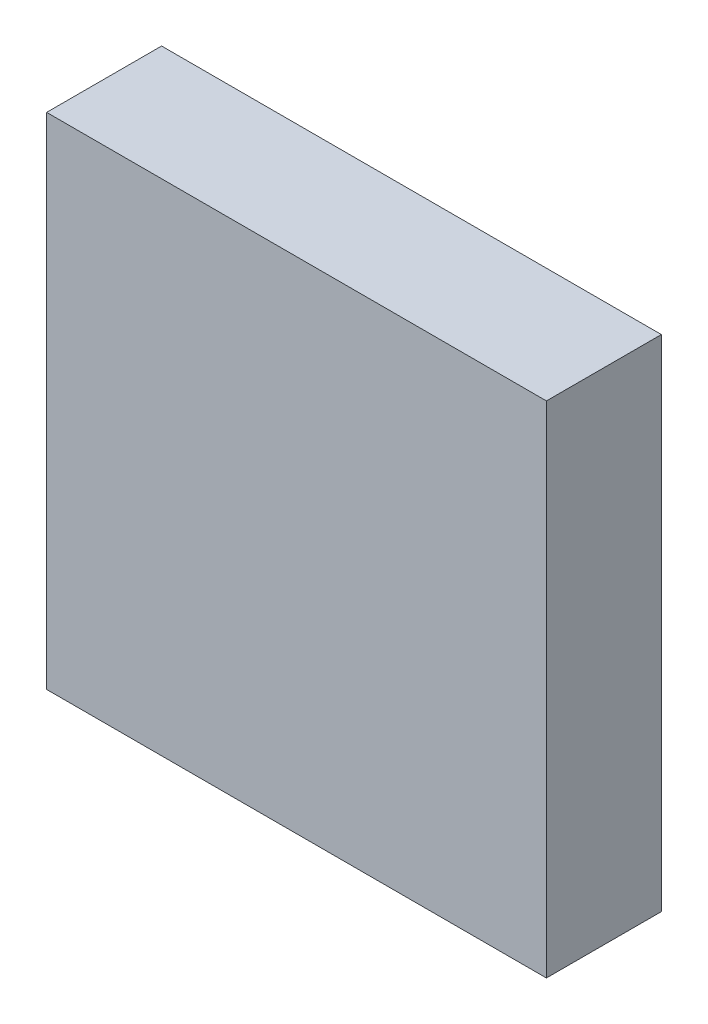
ISO-10303-21;
HEADER;
FILE_DESCRIPTION(('STEP AP214'),'2;1');
FILE_NAME('part.step','',(''),(''),'','','');
FILE_SCHEMA(('AUTOMOTIVE_DESIGN { 1 0 10303 214 1 1 1 1 }'));
ENDSEC;
DATA;
#1=APPLICATION_CONTEXT('core data for automotive mechanical design processes');
#2=APPLICATION_PROTOCOL_DEFINITION('international standard','automotive_design',2000,#1);
#3=PRODUCT_CONTEXT('',#1,'mechanical');
#4=PRODUCT('Part','Part','',(#3));
#5=PRODUCT_RELATED_PRODUCT_CATEGORY('part','',(#4));
#6=PRODUCT_DEFINITION_FORMATION('','',#4);
#7=PRODUCT_DEFINITION_CONTEXT('part definition',#1,'design');
#8=PRODUCT_DEFINITION('design','',#6,#7);
#9=PRODUCT_DEFINITION_SHAPE('','',#8);
#10=(LENGTH_UNIT() NAMED_UNIT(*) SI_UNIT(.MILLI.,.METRE.));
#11=(NAMED_UNIT(*) PLANE_ANGLE_UNIT() SI_UNIT($,.RADIAN.));
#12=(NAMED_UNIT(*) SI_UNIT($,.STERADIAN.) SOLID_ANGLE_UNIT());
#13=UNCERTAINTY_MEASURE_WITH_UNIT(LENGTH_MEASURE(1.E-05),#10,'distance_accuracy_value','');
#14=(GEOMETRIC_REPRESENTATION_CONTEXT(3) GLOBAL_UNCERTAINTY_ASSIGNED_CONTEXT((#13)) GLOBAL_UNIT_ASSIGNED_CONTEXT((#10,
#11,#12)) REPRESENTATION_CONTEXT('',''));
#15=CARTESIAN_POINT('',(0.,0.,0.));
#16=DIRECTION('',(0.,0.,1.));
#17=DIRECTION('',(1.,0.,0.));
#18=AXIS2_PLACEMENT_3D('',#15,#16,#17);
#19=CARTESIAN_POINT('',(35.499174310354,29.6252967338106,2.3));
#20=DIRECTION('',(1.,0.,0.));
#21=DIRECTION('',(0.,0.,-1.));
#22=AXIS2_PLACEMENT_3D('',#19,#20,#21);
#23=PLANE('',#22);
#24=DIRECTION('',(0.,-1.,0.));
#25=VECTOR('',#24,1.);
#26=CARTESIAN_POINT('',(35.499174310354,29.6252967338106,0.));
#27=LINE('',#26,#25);
#28=CARTESIAN_POINT('',(35.499174310354,29.6252967338106,0.));
#29=VERTEX_POINT('',#28);
#30=CARTESIAN_POINT('',(35.499174310354,19.6252967338106,0.));
#31=VERTEX_POINT('',#30);
#32=EDGE_CURVE('E110',#29,#31,#27,.T.);
#33=ORIENTED_EDGE('',*,*,#32,.T.);
#34=DIRECTION('',(0.,0.,-1.));
#35=VECTOR('',#34,1.);
#36=CARTESIAN_POINT('',(35.499174310354,19.6252967338106,2.3));
#37=LINE('',#36,#35);
#38=CARTESIAN_POINT('',(35.499174310354,19.6252967338106,2.3));
#39=VERTEX_POINT('',#38);
#40=EDGE_CURVE('E11',#39,#31,#37,.T.);
#41=ORIENTED_EDGE('',*,*,#40,.F.);
#42=DIRECTION('',(0.,-1.,0.));
#43=VECTOR('',#42,1.);
#44=CARTESIAN_POINT('',(35.499174310354,29.6252967338106,2.3));
#45=LINE('',#44,#43);
#46=CARTESIAN_POINT('',(35.499174310354,29.6252967338106,2.3));
#47=VERTEX_POINT('',#46);
#48=EDGE_CURVE('E93',#47,#39,#45,.T.);
#49=ORIENTED_EDGE('',*,*,#48,.F.);
#50=DIRECTION('',(0.,0.,-1.));
#51=VECTOR('',#50,1.);
#52=CARTESIAN_POINT('',(35.499174310354,29.6252967338106,2.3));
#53=LINE('',#52,#51);
#54=EDGE_CURVE('E106',#47,#29,#53,.T.);
#55=ORIENTED_EDGE('',*,*,#54,.T.);
#56=EDGE_LOOP('',(#33,#41,#49,#55));
#57=FACE_BOUND('',#56,.T.);
#58=ADVANCED_FACE('F41',(#57),#23,.F.);
#59=CARTESIAN_POINT('',(35.499174310354,19.6252967338106,2.3));
#60=DIRECTION('',(0.,1.,0.));
#61=DIRECTION('',(0.,0.,1.));
#62=AXIS2_PLACEMENT_3D('',#59,#60,#61);
#63=PLANE('',#62);
#64=DIRECTION('',(1.,0.,0.));
#65=VECTOR('',#64,1.);
#66=CARTESIAN_POINT('',(35.499174310354,19.6252967338106,0.));
#67=LINE('',#66,#65);
#68=CARTESIAN_POINT('',(45.499174310354,19.6252967338106,0.));
#69=VERTEX_POINT('',#68);
#70=EDGE_CURVE('E98',#31,#69,#67,.T.);
#71=ORIENTED_EDGE('',*,*,#70,.T.);
#72=DIRECTION('',(0.,0.,-1.));
#73=VECTOR('',#72,1.);
#74=CARTESIAN_POINT('',(45.499174310354,19.6252967338106,2.3));
#75=LINE('',#74,#73);
#76=CARTESIAN_POINT('',(45.499174310354,19.6252967338106,2.3));
#77=VERTEX_POINT('',#76);
#78=EDGE_CURVE('E50',#77,#69,#75,.T.);
#79=ORIENTED_EDGE('',*,*,#78,.F.);
#80=DIRECTION('',(1.,0.,0.));
#81=VECTOR('',#80,1.);
#82=CARTESIAN_POINT('',(35.499174310354,19.6252967338106,2.3));
#83=LINE('',#82,#81);
#84=EDGE_CURVE('E88',#39,#77,#83,.T.);
#85=ORIENTED_EDGE('',*,*,#84,.F.);
#86=ORIENTED_EDGE('',*,*,#40,.T.);
#87=EDGE_LOOP('',(#71,#79,#85,#86));
#88=FACE_BOUND('',#87,.T.);
#89=ADVANCED_FACE('F97',(#88),#63,.F.);
#90=CARTESIAN_POINT('',(45.499174310354,29.6252967338106,2.3));
#91=DIRECTION('',(-1.,0.,0.));
#92=DIRECTION('',(0.,-1.,0.));
#93=AXIS2_PLACEMENT_3D('',#90,#91,#92);
#94=PLANE('',#93);
#95=DIRECTION('',(0.,1.,0.));
#96=VECTOR('',#95,1.);
#97=CARTESIAN_POINT('',(45.499174310354,29.6252967338106,0.));
#98=LINE('',#97,#96);
#99=CARTESIAN_POINT('',(45.499174310354,29.6252967338106,0.));
#100=VERTEX_POINT('',#99);
#101=EDGE_CURVE('E75',#69,#100,#98,.T.);
#102=ORIENTED_EDGE('',*,*,#101,.T.);
#103=DIRECTION('',(0.,0.,-1.));
#104=VECTOR('',#103,1.);
#105=CARTESIAN_POINT('',(45.499174310354,29.6252967338106,2.3));
#106=LINE('',#105,#104);
#107=CARTESIAN_POINT('',(45.499174310354,29.6252967338106,2.3));
#108=VERTEX_POINT('',#107);
#109=EDGE_CURVE('E100',#108,#100,#106,.T.);
#110=ORIENTED_EDGE('',*,*,#109,.F.);
#111=DIRECTION('',(0.,1.,0.));
#112=VECTOR('',#111,1.);
#113=CARTESIAN_POINT('',(45.499174310354,29.6252967338106,2.3));
#114=LINE('',#113,#112);
#115=EDGE_CURVE('E91',#77,#108,#114,.T.);
#116=ORIENTED_EDGE('',*,*,#115,.F.);
#117=ORIENTED_EDGE('',*,*,#78,.T.);
#118=EDGE_LOOP('',(#102,#110,#116,#117));
#119=FACE_BOUND('',#118,.T.);
#120=ADVANCED_FACE('F101',(#119),#94,.F.);
#121=CARTESIAN_POINT('',(35.499174310354,29.6252967338106,2.3));
#122=DIRECTION('',(0.,-1.,0.));
#123=DIRECTION('',(0.,0.,-1.));
#124=AXIS2_PLACEMENT_3D('',#121,#122,#123);
#125=PLANE('',#124);
#126=DIRECTION('',(-1.,0.,0.));
#127=VECTOR('',#126,1.);
#128=CARTESIAN_POINT('',(35.499174310354,29.6252967338106,0.));
#129=LINE('',#128,#127);
#130=EDGE_CURVE('E81',#100,#29,#129,.T.);
#131=ORIENTED_EDGE('',*,*,#130,.T.);
#132=ORIENTED_EDGE('',*,*,#54,.F.);
#133=DIRECTION('',(-1.,0.,0.));
#134=VECTOR('',#133,1.);
#135=CARTESIAN_POINT('',(35.499174310354,29.6252967338106,2.3));
#136=LINE('',#135,#134);
#137=EDGE_CURVE('E58',#108,#47,#136,.T.);
#138=ORIENTED_EDGE('',*,*,#137,.F.);
#139=ORIENTED_EDGE('',*,*,#109,.T.);
#140=EDGE_LOOP('',(#131,#132,#138,#139));
#141=FACE_BOUND('',#140,.T.);
#142=ADVANCED_FACE('F123',(#141),#125,.F.);
#143=CARTESIAN_POINT('',(0.,0.,2.3));
#144=DIRECTION('',(0.,0.,1.));
#145=DIRECTION('',(1.,0.,0.));
#146=AXIS2_PLACEMENT_3D('',#143,#144,#145);
#147=PLANE('',#146);
#148=ORIENTED_EDGE('',*,*,#48,.T.);
#149=ORIENTED_EDGE('',*,*,#84,.T.);
#150=ORIENTED_EDGE('',*,*,#115,.T.);
#151=ORIENTED_EDGE('',*,*,#137,.T.);
#152=EDGE_LOOP('',(#148,#149,#150,#151));
#153=FACE_BOUND('',#152,.T.);
#154=ADVANCED_FACE('F89',(#153),#147,.T.);
#155=CARTESIAN_POINT('',(0.,0.,0.));
#156=DIRECTION('',(0.,0.,1.));
#157=DIRECTION('',(1.,0.,0.));
#158=AXIS2_PLACEMENT_3D('',#155,#156,#157);
#159=PLANE('',#158);
#160=ORIENTED_EDGE('',*,*,#32,.F.);
#161=ORIENTED_EDGE('',*,*,#130,.F.);
#162=ORIENTED_EDGE('',*,*,#101,.F.);
#163=ORIENTED_EDGE('',*,*,#70,.F.);
#164=EDGE_LOOP('',(#160,#161,#162,#163));
#165=FACE_BOUND('',#164,.T.);
#166=ADVANCED_FACE('F126',(#165),#159,.F.);
#167=CLOSED_SHELL('',(#58,#89,#120,#142,#154,#166));
#168=MANIFOLD_SOLID_BREP('B2',#167);
#169=ADVANCED_BREP_SHAPE_REPRESENTATION('',(#18,#168),#14);
#170=SHAPE_DEFINITION_REPRESENTATION(#9,#169);
ENDSEC;
END-ISO-10303-21;
